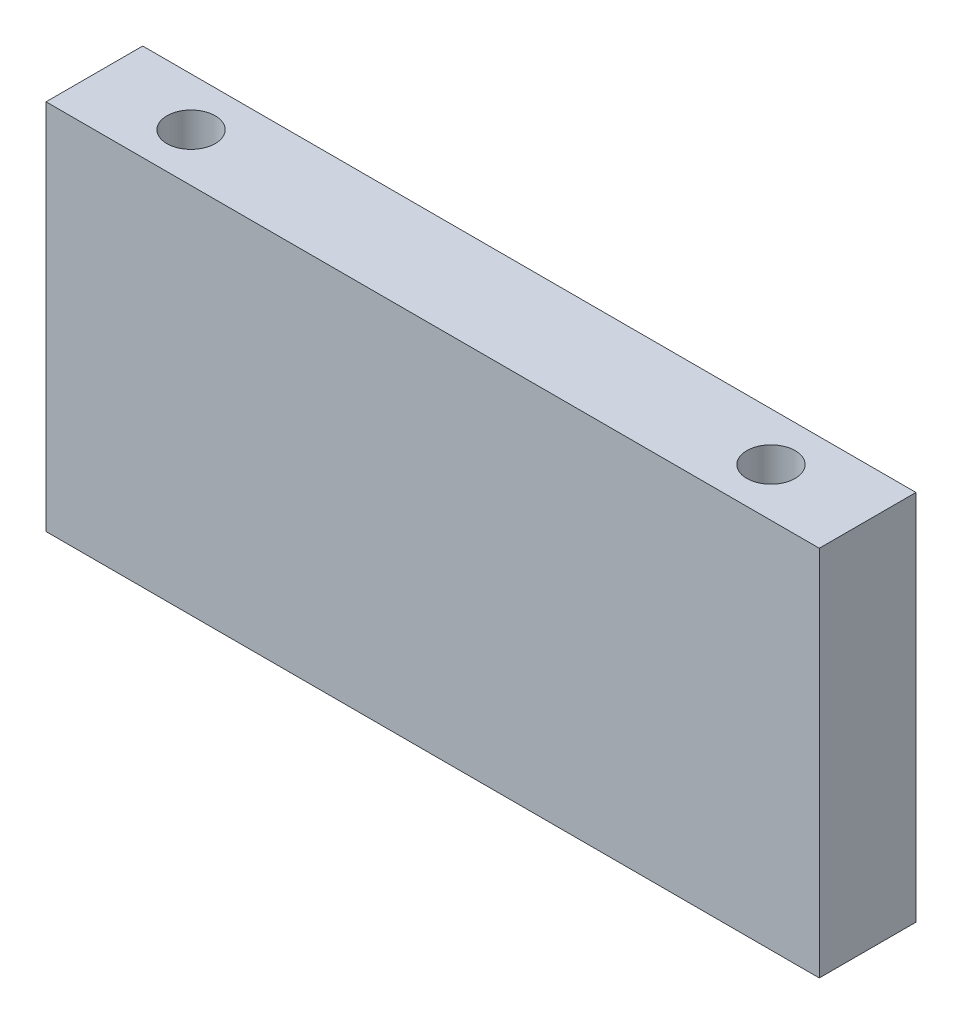
ISO-10303-21;
HEADER;
FILE_DESCRIPTION(('STEP AP214'),'2;1');
FILE_NAME('part.step','',(''),(''),'','','');
FILE_SCHEMA(('AUTOMOTIVE_DESIGN { 1 0 10303 214 1 1 1 1 }'));
ENDSEC;
DATA;
#1=APPLICATION_CONTEXT('core data for automotive mechanical design processes');
#2=APPLICATION_PROTOCOL_DEFINITION('international standard','automotive_design',2000,#1);
#3=PRODUCT_CONTEXT('',#1,'mechanical');
#4=PRODUCT('Part','Part','',(#3));
#5=PRODUCT_RELATED_PRODUCT_CATEGORY('part','',(#4));
#6=PRODUCT_DEFINITION_FORMATION('','',#4);
#7=PRODUCT_DEFINITION_CONTEXT('part definition',#1,'design');
#8=PRODUCT_DEFINITION('design','',#6,#7);
#9=PRODUCT_DEFINITION_SHAPE('','',#8);
#10=(LENGTH_UNIT() NAMED_UNIT(*) SI_UNIT(.MILLI.,.METRE.));
#11=(NAMED_UNIT(*) PLANE_ANGLE_UNIT() SI_UNIT($,.RADIAN.));
#12=(NAMED_UNIT(*) SI_UNIT($,.STERADIAN.) SOLID_ANGLE_UNIT());
#13=UNCERTAINTY_MEASURE_WITH_UNIT(LENGTH_MEASURE(1.E-05),#10,'distance_accuracy_value','');
#14=(GEOMETRIC_REPRESENTATION_CONTEXT(3) GLOBAL_UNCERTAINTY_ASSIGNED_CONTEXT((#13)) GLOBAL_UNIT_ASSIGNED_CONTEXT((#10,
#11,#12)) REPRESENTATION_CONTEXT('',''));
#15=CARTESIAN_POINT('',(0.,0.,0.));
#16=DIRECTION('',(0.,0.,1.));
#17=DIRECTION('',(1.,0.,0.));
#18=AXIS2_PLACEMENT_3D('',#15,#16,#17);
#19=CARTESIAN_POINT('',(-76.1999999999999,-36.6776,9.52500000000001));
#20=DIRECTION('',(0.,-1.,0.));
#21=DIRECTION('',(0.,0.,-1.));
#22=AXIS2_PLACEMENT_3D('',#19,#20,#21);
#23=PLANE('',#22);
#24=CARTESIAN_POINT('',(-57.15,-36.6776,0.));
#25=DIRECTION('',(0.,1.,0.));
#26=DIRECTION('',(0.,0.,1.));
#27=AXIS2_PLACEMENT_3D('',#24,#25,#26);
#28=CIRCLE('',#27,4.7625);
#29=CARTESIAN_POINT('',(-57.15,-36.6776,4.7625));
#30=VERTEX_POINT('',#29);
#31=EDGE_CURVE('E130',#30,#30,#28,.T.);
#32=ORIENTED_EDGE('',*,*,#31,.T.);
#33=EDGE_LOOP('',(#32));
#34=FACE_BOUND('',#33,.T.);
#35=DIRECTION('',(0.,0.,1.));
#36=VECTOR('',#35,1.);
#37=CARTESIAN_POINT('',(-76.2,-36.6776,-9.52499999999999));
#38=LINE('',#37,#36);
#39=CARTESIAN_POINT('',(-76.2,-36.6776,-9.52499999999999));
#40=VERTEX_POINT('',#39);
#41=CARTESIAN_POINT('',(-76.2,-36.6776,9.52500000000001));
#42=VERTEX_POINT('',#41);
#43=EDGE_CURVE('E104',#40,#42,#38,.T.);
#44=ORIENTED_EDGE('',*,*,#43,.F.);
#45=DIRECTION('',(-1.,0.,0.));
#46=VECTOR('',#45,1.);
#47=CARTESIAN_POINT('',(76.2,-36.6776,-9.52500000000001));
#48=LINE('',#47,#46);
#49=CARTESIAN_POINT('',(76.2,-36.6776,-9.52500000000001));
#50=VERTEX_POINT('',#49);
#51=EDGE_CURVE('E79',#50,#40,#48,.T.);
#52=ORIENTED_EDGE('',*,*,#51,.F.);
#53=DIRECTION('',(0.,0.,-1.));
#54=VECTOR('',#53,1.);
#55=CARTESIAN_POINT('',(76.2,-36.6776,-9.52500000000001));
#56=LINE('',#55,#54);
#57=CARTESIAN_POINT('',(76.2,-36.6776,9.52499999999999));
#58=VERTEX_POINT('',#57);
#59=EDGE_CURVE('E73',#58,#50,#56,.T.);
#60=ORIENTED_EDGE('',*,*,#59,.F.);
#61=DIRECTION('',(1.,0.,0.));
#62=VECTOR('',#61,1.);
#63=CARTESIAN_POINT('',(76.2,-36.6776,9.52499999999999));
#64=LINE('',#63,#62);
#65=EDGE_CURVE('E95',#42,#58,#64,.T.);
#66=ORIENTED_EDGE('',*,*,#65,.F.);
#67=EDGE_LOOP('',(#44,#52,#60,#66));
#68=FACE_BOUND('',#67,.T.);
#69=CARTESIAN_POINT('',(57.15,-36.6776,0.));
#70=DIRECTION('',(0.,1.,0.));
#71=DIRECTION('',(0.,0.,1.));
#72=AXIS2_PLACEMENT_3D('',#69,#70,#71);
#73=CIRCLE('',#72,4.7625);
#74=CARTESIAN_POINT('',(57.15,-36.6776,4.7625));
#75=VERTEX_POINT('',#74);
#76=EDGE_CURVE('E136',#75,#75,#73,.T.);
#77=ORIENTED_EDGE('',*,*,#76,.T.);
#78=EDGE_LOOP('',(#77));
#79=FACE_BOUND('',#78,.T.);
#80=ADVANCED_FACE('F39',(#34,#68,#79),#23,.T.);
#81=CARTESIAN_POINT('',(-76.2,36.6776,-9.52499999999999));
#82=DIRECTION('',(1.,0.,0.));
#83=DIRECTION('',(0.,0.,-1.));
#84=AXIS2_PLACEMENT_3D('',#81,#82,#83);
#85=PLANE('',#84);
#86=ORIENTED_EDGE('',*,*,#43,.T.);
#87=DIRECTION('',(0.,-1.,0.));
#88=VECTOR('',#87,1.);
#89=CARTESIAN_POINT('',(-76.2,36.6776,9.52500000000001));
#90=LINE('',#89,#88);
#91=CARTESIAN_POINT('',(-76.2,36.6776,9.52500000000001));
#92=VERTEX_POINT('',#91);
#93=EDGE_CURVE('E11',#92,#42,#90,.T.);
#94=ORIENTED_EDGE('',*,*,#93,.F.);
#95=DIRECTION('',(0.,0.,1.));
#96=VECTOR('',#95,1.);
#97=CARTESIAN_POINT('',(-76.2,36.6776,-9.52499999999999));
#98=LINE('',#97,#96);
#99=CARTESIAN_POINT('',(-76.2,36.6776,-9.52499999999999));
#100=VERTEX_POINT('',#99);
#101=EDGE_CURVE('E91',#100,#92,#98,.T.);
#102=ORIENTED_EDGE('',*,*,#101,.F.);
#103=DIRECTION('',(0.,-1.,0.));
#104=VECTOR('',#103,1.);
#105=CARTESIAN_POINT('',(-76.2,36.6776,-9.52499999999999));
#106=LINE('',#105,#104);
#107=EDGE_CURVE('E100',#100,#40,#106,.T.);
#108=ORIENTED_EDGE('',*,*,#107,.T.);
#109=EDGE_LOOP('',(#86,#94,#102,#108));
#110=FACE_BOUND('',#109,.T.);
#111=ADVANCED_FACE('F41',(#110),#85,.F.);
#112=CARTESIAN_POINT('',(76.2,36.6776,9.52499999999999));
#113=DIRECTION('',(0.,0.,-1.));
#114=DIRECTION('',(-1.,0.,0.));
#115=AXIS2_PLACEMENT_3D('',#112,#113,#114);
#116=PLANE('',#115);
#117=ORIENTED_EDGE('',*,*,#65,.T.);
#118=DIRECTION('',(0.,-1.,0.));
#119=VECTOR('',#118,1.);
#120=CARTESIAN_POINT('',(76.2,36.6776,9.52499999999999));
#121=LINE('',#120,#119);
#122=CARTESIAN_POINT('',(76.2,36.6776,9.52499999999999));
#123=VERTEX_POINT('',#122);
#124=EDGE_CURVE('E48',#123,#58,#121,.T.);
#125=ORIENTED_EDGE('',*,*,#124,.F.);
#126=DIRECTION('',(1.,0.,0.));
#127=VECTOR('',#126,1.);
#128=CARTESIAN_POINT('',(76.2,36.6776,9.52499999999999));
#129=LINE('',#128,#127);
#130=EDGE_CURVE('E86',#92,#123,#129,.T.);
#131=ORIENTED_EDGE('',*,*,#130,.F.);
#132=ORIENTED_EDGE('',*,*,#93,.T.);
#133=EDGE_LOOP('',(#117,#125,#131,#132));
#134=FACE_BOUND('',#133,.T.);
#135=ADVANCED_FACE('F94',(#134),#116,.F.);
#136=CARTESIAN_POINT('',(76.2,36.6776,-9.52500000000001));
#137=DIRECTION('',(-1.,0.,0.));
#138=DIRECTION('',(0.,0.,1.));
#139=AXIS2_PLACEMENT_3D('',#136,#137,#138);
#140=PLANE('',#139);
#141=ORIENTED_EDGE('',*,*,#59,.T.);
#142=DIRECTION('',(0.,-1.,0.));
#143=VECTOR('',#142,1.);
#144=CARTESIAN_POINT('',(76.2,36.6776,-9.52500000000001));
#145=LINE('',#144,#143);
#146=CARTESIAN_POINT('',(76.2,36.6776,-9.52500000000001));
#147=VERTEX_POINT('',#146);
#148=EDGE_CURVE('E96',#147,#50,#145,.T.);
#149=ORIENTED_EDGE('',*,*,#148,.F.);
#150=DIRECTION('',(0.,0.,-1.));
#151=VECTOR('',#150,1.);
#152=CARTESIAN_POINT('',(76.2,36.6776,-9.52500000000001));
#153=LINE('',#152,#151);
#154=EDGE_CURVE('E89',#123,#147,#153,.T.);
#155=ORIENTED_EDGE('',*,*,#154,.F.);
#156=ORIENTED_EDGE('',*,*,#124,.T.);
#157=EDGE_LOOP('',(#141,#149,#155,#156));
#158=FACE_BOUND('',#157,.T.);
#159=ADVANCED_FACE('F97',(#158),#140,.F.);
#160=CARTESIAN_POINT('',(76.2,36.6776,-9.52500000000001));
#161=DIRECTION('',(0.,0.,1.));
#162=DIRECTION('',(1.,0.,0.));
#163=AXIS2_PLACEMENT_3D('',#160,#161,#162);
#164=PLANE('',#163);
#165=ORIENTED_EDGE('',*,*,#51,.T.);
#166=ORIENTED_EDGE('',*,*,#107,.F.);
#167=DIRECTION('',(-1.,0.,0.));
#168=VECTOR('',#167,1.);
#169=CARTESIAN_POINT('',(76.2,36.6776,-9.52500000000001));
#170=LINE('',#169,#168);
#171=EDGE_CURVE('E56',#147,#100,#170,.T.);
#172=ORIENTED_EDGE('',*,*,#171,.F.);
#173=ORIENTED_EDGE('',*,*,#148,.T.);
#174=EDGE_LOOP('',(#165,#166,#172,#173));
#175=FACE_BOUND('',#174,.T.);
#176=ADVANCED_FACE('F112',(#175),#164,.F.);
#177=CARTESIAN_POINT('',(-76.1999999999999,36.6776,9.52500000000001));
#178=DIRECTION('',(0.,-1.,0.));
#179=DIRECTION('',(0.,0.,-1.));
#180=AXIS2_PLACEMENT_3D('',#177,#178,#179);
#181=PLANE('',#180);
#182=CARTESIAN_POINT('',(57.15,36.6776,0.));
#183=DIRECTION('',(0.,1.,0.));
#184=DIRECTION('',(0.,0.,1.));
#185=AXIS2_PLACEMENT_3D('',#182,#183,#184);
#186=CIRCLE('',#185,4.7625);
#187=CARTESIAN_POINT('',(57.15,36.6776,4.7625));
#188=VERTEX_POINT('',#187);
#189=EDGE_CURVE('E124',#188,#188,#186,.T.);
#190=ORIENTED_EDGE('',*,*,#189,.F.);
#191=EDGE_LOOP('',(#190));
#192=FACE_BOUND('',#191,.T.);
#193=CARTESIAN_POINT('',(-57.15,36.6776,0.));
#194=DIRECTION('',(0.,1.,0.));
#195=DIRECTION('',(0.,0.,1.));
#196=AXIS2_PLACEMENT_3D('',#193,#194,#195);
#197=CIRCLE('',#196,4.7625);
#198=CARTESIAN_POINT('',(-57.15,36.6776,4.7625));
#199=VERTEX_POINT('',#198);
#200=EDGE_CURVE('E118',#199,#199,#197,.T.);
#201=ORIENTED_EDGE('',*,*,#200,.F.);
#202=EDGE_LOOP('',(#201));
#203=FACE_BOUND('',#202,.T.);
#204=ORIENTED_EDGE('',*,*,#101,.T.);
#205=ORIENTED_EDGE('',*,*,#130,.T.);
#206=ORIENTED_EDGE('',*,*,#154,.T.);
#207=ORIENTED_EDGE('',*,*,#171,.T.);
#208=EDGE_LOOP('',(#204,#205,#206,#207));
#209=FACE_BOUND('',#208,.T.);
#210=ADVANCED_FACE('F87',(#192,#203,#209),#181,.F.);
#211=CARTESIAN_POINT('',(-57.15,17.6276,0.));
#212=DIRECTION('',(0.,1.,0.));
#213=DIRECTION('',(0.,0.,1.));
#214=AXIS2_PLACEMENT_3D('',#211,#212,#213);
#215=CYLINDRICAL_SURFACE('',#214,4.7625);
#216=CARTESIAN_POINT('',(-57.15,17.6276,0.));
#217=DIRECTION('',(0.,1.,0.));
#218=DIRECTION('',(0.,0.,1.));
#219=AXIS2_PLACEMENT_3D('',#216,#217,#218);
#220=CIRCLE('',#219,4.7625);
#221=CARTESIAN_POINT('',(-57.15,17.6276,4.7625));
#222=VERTEX_POINT('',#221);
#223=EDGE_CURVE('E107',#222,#222,#220,.T.);
#224=ORIENTED_EDGE('',*,*,#223,.F.);
#225=EDGE_LOOP('',(#224));
#226=FACE_BOUND('',#225,.T.);
#227=ORIENTED_EDGE('',*,*,#200,.T.);
#228=EDGE_LOOP('',(#227));
#229=FACE_BOUND('',#228,.T.);
#230=ADVANCED_FACE('F183',(#226,#229),#215,.F.);
#231=CARTESIAN_POINT('',(-57.15,17.6276,0.));
#232=DIRECTION('',(0.,1.,0.));
#233=DIRECTION('',(0.,0.,1.));
#234=AXIS2_PLACEMENT_3D('',#231,#232,#233);
#235=PLANE('',#234);
#236=ORIENTED_EDGE('',*,*,#223,.T.);
#237=EDGE_LOOP('',(#236));
#238=FACE_BOUND('',#237,.T.);
#239=ADVANCED_FACE('F189',(#238),#235,.T.);
#240=CARTESIAN_POINT('',(57.15,17.6276,0.));
#241=DIRECTION('',(0.,1.,0.));
#242=DIRECTION('',(0.,0.,1.));
#243=AXIS2_PLACEMENT_3D('',#240,#241,#242);
#244=CYLINDRICAL_SURFACE('',#243,4.7625);
#245=CARTESIAN_POINT('',(57.15,17.6276,0.));
#246=DIRECTION('',(0.,1.,0.));
#247=DIRECTION('',(0.,0.,1.));
#248=AXIS2_PLACEMENT_3D('',#245,#246,#247);
#249=CIRCLE('',#248,4.7625);
#250=CARTESIAN_POINT('',(57.15,17.6276,4.7625));
#251=VERTEX_POINT('',#250);
#252=EDGE_CURVE('E121',#251,#251,#249,.T.);
#253=ORIENTED_EDGE('',*,*,#252,.F.);
#254=EDGE_LOOP('',(#253));
#255=FACE_BOUND('',#254,.T.);
#256=ORIENTED_EDGE('',*,*,#189,.T.);
#257=EDGE_LOOP('',(#256));
#258=FACE_BOUND('',#257,.T.);
#259=ADVANCED_FACE('F196',(#255,#258),#244,.F.);
#260=CARTESIAN_POINT('',(57.15,17.6276,0.));
#261=DIRECTION('',(0.,1.,0.));
#262=DIRECTION('',(0.,0.,1.));
#263=AXIS2_PLACEMENT_3D('',#260,#261,#262);
#264=PLANE('',#263);
#265=ORIENTED_EDGE('',*,*,#252,.T.);
#266=EDGE_LOOP('',(#265));
#267=FACE_BOUND('',#266,.T.);
#268=ADVANCED_FACE('F204',(#267),#264,.T.);
#269=CARTESIAN_POINT('',(-57.15,-17.6276,0.));
#270=DIRECTION('',(0.,-1.,0.));
#271=DIRECTION('',(0.,0.,-1.));
#272=AXIS2_PLACEMENT_3D('',#269,#270,#271);
#273=CYLINDRICAL_SURFACE('',#272,4.7625);
#274=CARTESIAN_POINT('',(-57.15,-17.6276,0.));
#275=DIRECTION('',(0.,1.,0.));
#276=DIRECTION('',(0.,0.,1.));
#277=AXIS2_PLACEMENT_3D('',#274,#275,#276);
#278=CIRCLE('',#277,4.7625);
#279=CARTESIAN_POINT('',(-57.15,-17.6276,4.7625));
#280=VERTEX_POINT('',#279);
#281=EDGE_CURVE('E127',#280,#280,#278,.T.);
#282=ORIENTED_EDGE('',*,*,#281,.T.);
#283=EDGE_LOOP('',(#282));
#284=FACE_BOUND('',#283,.T.);
#285=ORIENTED_EDGE('',*,*,#31,.F.);
#286=EDGE_LOOP('',(#285));
#287=FACE_BOUND('',#286,.T.);
#288=ADVANCED_FACE('F212',(#284,#287),#273,.F.);
#289=CARTESIAN_POINT('',(-57.15,-17.6276,0.));
#290=DIRECTION('',(0.,-1.,0.));
#291=DIRECTION('',(0.,0.,1.));
#292=AXIS2_PLACEMENT_3D('',#289,#290,#291);
#293=PLANE('',#292);
#294=ORIENTED_EDGE('',*,*,#281,.F.);
#295=EDGE_LOOP('',(#294));
#296=FACE_BOUND('',#295,.T.);
#297=ADVANCED_FACE('F151',(#296),#293,.T.);
#298=CARTESIAN_POINT('',(57.15,-17.6276,0.));
#299=DIRECTION('',(0.,-1.,0.));
#300=DIRECTION('',(0.,0.,-1.));
#301=AXIS2_PLACEMENT_3D('',#298,#299,#300);
#302=CYLINDRICAL_SURFACE('',#301,4.7625);
#303=CARTESIAN_POINT('',(57.15,-17.6276,0.));
#304=DIRECTION('',(0.,1.,0.));
#305=DIRECTION('',(0.,0.,1.));
#306=AXIS2_PLACEMENT_3D('',#303,#304,#305);
#307=CIRCLE('',#306,4.7625);
#308=CARTESIAN_POINT('',(57.15,-17.6276,4.7625));
#309=VERTEX_POINT('',#308);
#310=EDGE_CURVE('E133',#309,#309,#307,.T.);
#311=ORIENTED_EDGE('',*,*,#310,.T.);
#312=EDGE_LOOP('',(#311));
#313=FACE_BOUND('',#312,.T.);
#314=ORIENTED_EDGE('',*,*,#76,.F.);
#315=EDGE_LOOP('',(#314));
#316=FACE_BOUND('',#315,.T.);
#317=ADVANCED_FACE('F142',(#313,#316),#302,.F.);
#318=CARTESIAN_POINT('',(57.15,-17.6276,0.));
#319=DIRECTION('',(0.,-1.,0.));
#320=DIRECTION('',(0.,0.,1.));
#321=AXIS2_PLACEMENT_3D('',#318,#319,#320);
#322=PLANE('',#321);
#323=ORIENTED_EDGE('',*,*,#310,.F.);
#324=EDGE_LOOP('',(#323));
#325=FACE_BOUND('',#324,.T.);
#326=ADVANCED_FACE('F145',(#325),#322,.T.);
#327=CLOSED_SHELL('',(#80,#111,#135,#159,#176,#210,#230,#239,#259,#268,#288,#297,#317,#326));
#328=MANIFOLD_SOLID_BREP('B2',#327);
#329=ADVANCED_BREP_SHAPE_REPRESENTATION('',(#18,#328),#14);
#330=SHAPE_DEFINITION_REPRESENTATION(#9,#329);
ENDSEC;
END-ISO-10303-21;
